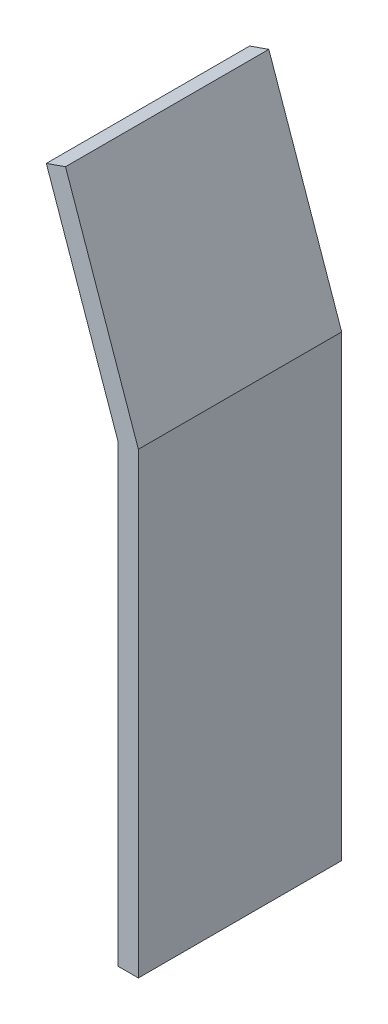
ISO-10303-21;
HEADER;
FILE_DESCRIPTION(('STEP AP214'),'2;1');
FILE_NAME('part.step','',(''),(''),'','','');
FILE_SCHEMA(('AUTOMOTIVE_DESIGN { 1 0 10303 214 1 1 1 1 }'));
ENDSEC;
DATA;
#1=APPLICATION_CONTEXT('core data for automotive mechanical design processes');
#2=APPLICATION_PROTOCOL_DEFINITION('international standard','automotive_design',2000,#1);
#3=PRODUCT_CONTEXT('',#1,'mechanical');
#4=PRODUCT('Part','Part','',(#3));
#5=PRODUCT_RELATED_PRODUCT_CATEGORY('part','',(#4));
#6=PRODUCT_DEFINITION_FORMATION('','',#4);
#7=PRODUCT_DEFINITION_CONTEXT('part definition',#1,'design');
#8=PRODUCT_DEFINITION('design','',#6,#7);
#9=PRODUCT_DEFINITION_SHAPE('','',#8);
#10=(LENGTH_UNIT() NAMED_UNIT(*) SI_UNIT(.MILLI.,.METRE.));
#11=(NAMED_UNIT(*) PLANE_ANGLE_UNIT() SI_UNIT($,.RADIAN.));
#12=(NAMED_UNIT(*) SI_UNIT($,.STERADIAN.) SOLID_ANGLE_UNIT());
#13=UNCERTAINTY_MEASURE_WITH_UNIT(LENGTH_MEASURE(1.E-05),#10,'distance_accuracy_value','');
#14=(GEOMETRIC_REPRESENTATION_CONTEXT(3) GLOBAL_UNCERTAINTY_ASSIGNED_CONTEXT((#13)) GLOBAL_UNIT_ASSIGNED_CONTEXT((#10,
#11,#12)) REPRESENTATION_CONTEXT('',''));
#15=CARTESIAN_POINT('',(0.,0.,0.));
#16=DIRECTION('',(0.,0.,1.));
#17=DIRECTION('',(1.,0.,0.));
#18=AXIS2_PLACEMENT_3D('',#15,#16,#17);
#19=CARTESIAN_POINT('',(-70.5473108409129,201.677149258699,200.));
#20=DIRECTION('',(0.943916265368806,0.330184923902054,0.));
#21=DIRECTION('',(-0.330184923902054,0.943916265368806,0.));
#22=AXIS2_PLACEMENT_3D('',#19,#20,#21);
#23=PLANE('',#22);
#24=DIRECTION('',(0.330184923902054,-0.943916265368806,0.));
#25=VECTOR('',#24,1.);
#26=CARTESIAN_POINT('',(-70.5473108409129,201.677149258699,0.));
#27=LINE('',#26,#25);
#28=CARTESIAN_POINT('',(-70.5473108409129,201.677149258699,0.));
#29=VERTEX_POINT('',#28);
#30=CARTESIAN_POINT('',(0.,0.,0.));
#31=VERTEX_POINT('',#30);
#32=EDGE_CURVE('E134',#29,#31,#27,.T.);
#33=ORIENTED_EDGE('',*,*,#32,.T.);
#34=DIRECTION('',(0.,0.,-1.));
#35=VECTOR('',#34,1.);
#36=CARTESIAN_POINT('',(0.,0.,200.));
#37=LINE('',#36,#35);
#38=CARTESIAN_POINT('',(0.,0.,200.));
#39=VERTEX_POINT('',#38);
#40=EDGE_CURVE('E11',#39,#31,#37,.T.);
#41=ORIENTED_EDGE('',*,*,#40,.F.);
#42=DIRECTION('',(0.330184923902054,-0.943916265368806,0.));
#43=VECTOR('',#42,1.);
#44=CARTESIAN_POINT('',(-70.5473108409129,201.677149258699,200.));
#45=LINE('',#44,#43);
#46=CARTESIAN_POINT('',(-70.5473108409129,201.677149258699,200.));
#47=VERTEX_POINT('',#46);
#48=EDGE_CURVE('E150',#47,#39,#45,.T.);
#49=ORIENTED_EDGE('',*,*,#48,.F.);
#50=DIRECTION('',(0.,0.,-1.));
#51=VECTOR('',#50,1.);
#52=CARTESIAN_POINT('',(-70.5473108409129,201.677149258699,200.));
#53=LINE('',#52,#51);
#54=EDGE_CURVE('E130',#47,#29,#53,.T.);
#55=ORIENTED_EDGE('',*,*,#54,.T.);
#56=EDGE_LOOP('',(#33,#41,#49,#55));
#57=FACE_BOUND('',#56,.T.);
#58=ADVANCED_FACE('F45',(#57),#23,.F.);
#59=CARTESIAN_POINT('',(0.,0.,200.));
#60=DIRECTION('',(1.,0.,0.));
#61=DIRECTION('',(0.,1.,0.));
#62=AXIS2_PLACEMENT_3D('',#59,#60,#61);
#63=PLANE('',#62);
#64=DIRECTION('',(0.,-1.,0.));
#65=VECTOR('',#64,1.);
#66=CARTESIAN_POINT('',(0.,0.,0.));
#67=LINE('',#66,#65);
#68=CARTESIAN_POINT('',(0.,-447.,0.));
#69=VERTEX_POINT('',#68);
#70=EDGE_CURVE('E138',#31,#69,#67,.T.);
#71=ORIENTED_EDGE('',*,*,#70,.T.);
#72=DIRECTION('',(0.,0.,-1.));
#73=VECTOR('',#72,1.);
#74=CARTESIAN_POINT('',(0.,-447.,200.));
#75=LINE('',#74,#73);
#76=CARTESIAN_POINT('',(0.,-447.,200.));
#77=VERTEX_POINT('',#76);
#78=EDGE_CURVE('E54',#77,#69,#75,.T.);
#79=ORIENTED_EDGE('',*,*,#78,.F.);
#80=DIRECTION('',(0.,-1.,0.));
#81=VECTOR('',#80,1.);
#82=CARTESIAN_POINT('',(0.,0.,200.));
#83=LINE('',#82,#81);
#84=EDGE_CURVE('E99',#39,#77,#83,.T.);
#85=ORIENTED_EDGE('',*,*,#84,.F.);
#86=ORIENTED_EDGE('',*,*,#40,.T.);
#87=EDGE_LOOP('',(#71,#79,#85,#86));
#88=FACE_BOUND('',#87,.T.);
#89=ADVANCED_FACE('F178',(#88),#63,.F.);
#90=CARTESIAN_POINT('',(0.,-447.,200.));
#91=DIRECTION('',(0.,1.,0.));
#92=DIRECTION('',(-1.,0.,0.));
#93=AXIS2_PLACEMENT_3D('',#90,#91,#92);
#94=PLANE('',#93);
#95=DIRECTION('',(1.,0.,0.));
#96=VECTOR('',#95,1.);
#97=CARTESIAN_POINT('',(0.,-447.,0.));
#98=LINE('',#97,#96);
#99=CARTESIAN_POINT('',(20.0000000000001,-447.,0.));
#100=VERTEX_POINT('',#99);
#101=EDGE_CURVE('E141',#69,#100,#98,.T.);
#102=ORIENTED_EDGE('',*,*,#101,.T.);
#103=DIRECTION('',(0.,0.,-1.));
#104=VECTOR('',#103,1.);
#105=CARTESIAN_POINT('',(20.0000000000001,-447.,200.));
#106=LINE('',#105,#104);
#107=CARTESIAN_POINT('',(20.0000000000001,-447.,200.));
#108=VERTEX_POINT('',#107);
#109=EDGE_CURVE('E123',#108,#100,#106,.T.);
#110=ORIENTED_EDGE('',*,*,#109,.F.);
#111=DIRECTION('',(1.,0.,0.));
#112=VECTOR('',#111,1.);
#113=CARTESIAN_POINT('',(0.,-447.,200.));
#114=LINE('',#113,#112);
#115=EDGE_CURVE('E112',#77,#108,#114,.T.);
#116=ORIENTED_EDGE('',*,*,#115,.F.);
#117=ORIENTED_EDGE('',*,*,#78,.T.);
#118=EDGE_LOOP('',(#102,#110,#116,#117));
#119=FACE_BOUND('',#118,.T.);
#120=ADVANCED_FACE('F160',(#119),#94,.F.);
#121=CARTESIAN_POINT('',(20.0000000000001,-447.,200.));
#122=DIRECTION('',(-1.,0.,0.));
#123=DIRECTION('',(0.,-1.,0.));
#124=AXIS2_PLACEMENT_3D('',#121,#122,#123);
#125=PLANE('',#124);
#126=DIRECTION('',(0.,1.,0.));
#127=VECTOR('',#126,1.);
#128=CARTESIAN_POINT('',(20.0000000000001,-447.,0.));
#129=LINE('',#128,#127);
#130=CARTESIAN_POINT('',(20.0000000000001,3.39711056267533,0.));
#131=VERTEX_POINT('',#130);
#132=EDGE_CURVE('E121',#100,#131,#129,.T.);
#133=ORIENTED_EDGE('',*,*,#132,.T.);
#134=DIRECTION('',(0.,0.,-1.));
#135=VECTOR('',#134,1.);
#136=CARTESIAN_POINT('',(20.0000000000001,3.39711056267533,200.));
#137=LINE('',#136,#135);
#138=CARTESIAN_POINT('',(20.0000000000001,3.39711056267533,200.));
#139=VERTEX_POINT('',#138);
#140=EDGE_CURVE('E118',#139,#131,#137,.T.);
#141=ORIENTED_EDGE('',*,*,#140,.F.);
#142=DIRECTION('',(0.,1.,0.));
#143=VECTOR('',#142,1.);
#144=CARTESIAN_POINT('',(20.0000000000001,-447.,200.));
#145=LINE('',#144,#143);
#146=EDGE_CURVE('E106',#108,#139,#145,.T.);
#147=ORIENTED_EDGE('',*,*,#146,.F.);
#148=ORIENTED_EDGE('',*,*,#109,.T.);
#149=EDGE_LOOP('',(#133,#141,#147,#148));
#150=FACE_BOUND('',#149,.T.);
#151=ADVANCED_FACE('F119',(#150),#125,.F.);
#152=CARTESIAN_POINT('',(-51.6689855326533,208.280847734215,200.));
#153=DIRECTION('',(-0.943916265368806,-0.330184923902054,0.));
#154=DIRECTION('',(0.330184923902054,-0.943916265368806,0.));
#155=AXIS2_PLACEMENT_3D('',#152,#153,#154);
#156=PLANE('',#155);
#157=DIRECTION('',(-0.330184923902054,0.943916265368806,0.));
#158=VECTOR('',#157,1.);
#159=CARTESIAN_POINT('',(-51.6689855326533,208.280847734215,0.));
#160=LINE('',#159,#158);
#161=CARTESIAN_POINT('',(-51.6689855326533,208.280847734215,0.));
#162=VERTEX_POINT('',#161);
#163=EDGE_CURVE('E85',#131,#162,#160,.T.);
#164=ORIENTED_EDGE('',*,*,#163,.T.);
#165=DIRECTION('',(0.,0.,-1.));
#166=VECTOR('',#165,1.);
#167=CARTESIAN_POINT('',(-51.6689855326533,208.280847734215,200.));
#168=LINE('',#167,#166);
#169=CARTESIAN_POINT('',(-51.6689855326533,208.280847734215,200.));
#170=VERTEX_POINT('',#169);
#171=EDGE_CURVE('E124',#170,#162,#168,.T.);
#172=ORIENTED_EDGE('',*,*,#171,.F.);
#173=DIRECTION('',(-0.330184923902054,0.943916265368806,0.));
#174=VECTOR('',#173,1.);
#175=CARTESIAN_POINT('',(-51.6689855326533,208.280847734215,200.));
#176=LINE('',#175,#174);
#177=EDGE_CURVE('E110',#139,#170,#176,.T.);
#178=ORIENTED_EDGE('',*,*,#177,.F.);
#179=ORIENTED_EDGE('',*,*,#140,.T.);
#180=EDGE_LOOP('',(#164,#172,#178,#179));
#181=FACE_BOUND('',#180,.T.);
#182=ADVANCED_FACE('F126',(#181),#156,.F.);
#183=CARTESIAN_POINT('',(-51.6689855326533,208.280847734215,200.));
#184=DIRECTION('',(0.330184923775774,-0.94391626541298,0.));
#185=DIRECTION('',(0.94391626541298,0.330184923775774,0.));
#186=AXIS2_PLACEMENT_3D('',#183,#184,#185);
#187=PLANE('',#186);
#188=DIRECTION('',(-0.943916265412979,-0.330184923775774,0.));
#189=VECTOR('',#188,1.);
#190=CARTESIAN_POINT('',(-51.6689855326533,208.280847734215,0.));
#191=LINE('',#190,#189);
#192=EDGE_CURVE('E91',#162,#29,#191,.T.);
#193=ORIENTED_EDGE('',*,*,#192,.T.);
#194=ORIENTED_EDGE('',*,*,#54,.F.);
#195=DIRECTION('',(-0.943916265412979,-0.330184923775774,0.));
#196=VECTOR('',#195,1.);
#197=CARTESIAN_POINT('',(-51.6689855326533,208.280847734215,200.));
#198=LINE('',#197,#196);
#199=EDGE_CURVE('E62',#170,#47,#198,.T.);
#200=ORIENTED_EDGE('',*,*,#199,.F.);
#201=ORIENTED_EDGE('',*,*,#171,.T.);
#202=EDGE_LOOP('',(#193,#194,#200,#201));
#203=FACE_BOUND('',#202,.T.);
#204=ADVANCED_FACE('F167',(#203),#187,.F.);
#205=CARTESIAN_POINT('',(0.,0.,200.));
#206=DIRECTION('',(0.,0.,-1.));
#207=DIRECTION('',(-1.,0.,0.));
#208=AXIS2_PLACEMENT_3D('',#205,#206,#207);
#209=PLANE('',#208);
#210=ORIENTED_EDGE('',*,*,#48,.T.);
#211=ORIENTED_EDGE('',*,*,#84,.T.);
#212=ORIENTED_EDGE('',*,*,#115,.T.);
#213=ORIENTED_EDGE('',*,*,#146,.T.);
#214=ORIENTED_EDGE('',*,*,#177,.T.);
#215=ORIENTED_EDGE('',*,*,#199,.T.);
#216=EDGE_LOOP('',(#210,#211,#212,#213,#214,#215));
#217=FACE_BOUND('',#216,.T.);
#218=ADVANCED_FACE('F108',(#217),#209,.F.);
#219=CARTESIAN_POINT('',(0.,0.,0.));
#220=DIRECTION('',(0.,0.,-1.));
#221=DIRECTION('',(-1.,0.,0.));
#222=AXIS2_PLACEMENT_3D('',#219,#220,#221);
#223=PLANE('',#222);
#224=ORIENTED_EDGE('',*,*,#32,.F.);
#225=ORIENTED_EDGE('',*,*,#192,.F.);
#226=ORIENTED_EDGE('',*,*,#163,.F.);
#227=ORIENTED_EDGE('',*,*,#132,.F.);
#228=ORIENTED_EDGE('',*,*,#101,.F.);
#229=ORIENTED_EDGE('',*,*,#70,.F.);
#230=EDGE_LOOP('',(#224,#225,#226,#227,#228,#229));
#231=FACE_BOUND('',#230,.T.);
#232=ADVANCED_FACE('F163',(#231),#223,.T.);
#233=CLOSED_SHELL('',(#58,#89,#120,#151,#182,#204,#218,#232));
#234=MANIFOLD_SOLID_BREP('B2',#233);
#235=ADVANCED_BREP_SHAPE_REPRESENTATION('',(#18,#234),#14);
#236=SHAPE_DEFINITION_REPRESENTATION(#9,#235);
ENDSEC;
END-ISO-10303-21;
